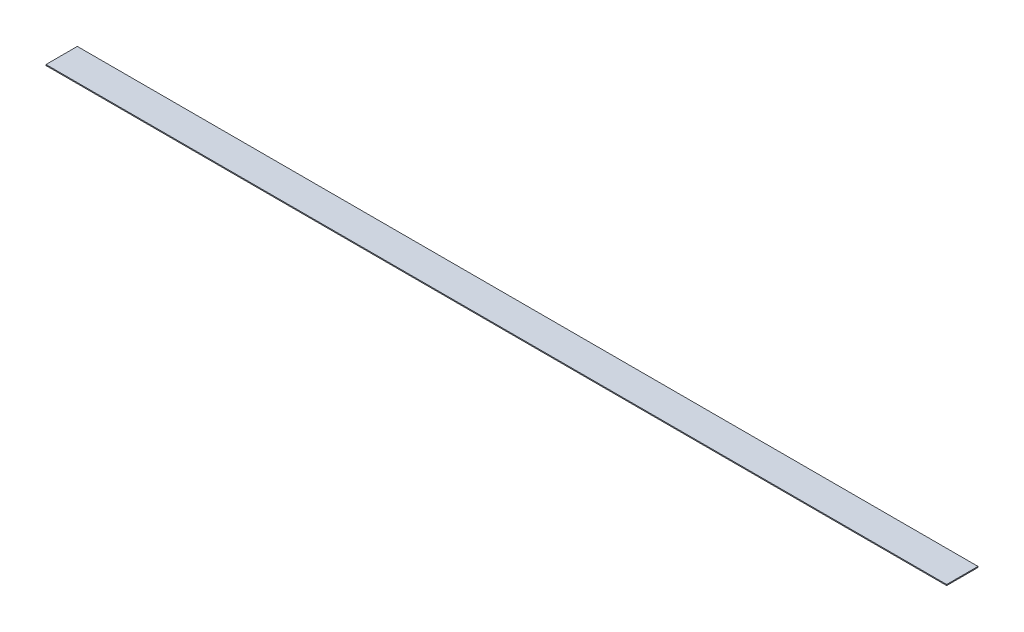
ISO-10303-21;
HEADER;
FILE_DESCRIPTION(('STEP AP214'),'2;1');
FILE_NAME('part.step','',(''),(''),'','','');
FILE_SCHEMA(('AUTOMOTIVE_DESIGN { 1 0 10303 214 1 1 1 1 }'));
ENDSEC;
DATA;
#1=APPLICATION_CONTEXT('core data for automotive mechanical design processes');
#2=APPLICATION_PROTOCOL_DEFINITION('international standard','automotive_design',2000,#1);
#3=PRODUCT_CONTEXT('',#1,'mechanical');
#4=PRODUCT('Part','Part','',(#3));
#5=PRODUCT_RELATED_PRODUCT_CATEGORY('part','',(#4));
#6=PRODUCT_DEFINITION_FORMATION('','',#4);
#7=PRODUCT_DEFINITION_CONTEXT('part definition',#1,'design');
#8=PRODUCT_DEFINITION('design','',#6,#7);
#9=PRODUCT_DEFINITION_SHAPE('','',#8);
#10=(LENGTH_UNIT() NAMED_UNIT(*) SI_UNIT(.MILLI.,.METRE.));
#11=(NAMED_UNIT(*) PLANE_ANGLE_UNIT() SI_UNIT($,.RADIAN.));
#12=(NAMED_UNIT(*) SI_UNIT($,.STERADIAN.) SOLID_ANGLE_UNIT());
#13=UNCERTAINTY_MEASURE_WITH_UNIT(LENGTH_MEASURE(1.E-05),#10,'distance_accuracy_value','');
#14=(GEOMETRIC_REPRESENTATION_CONTEXT(3) GLOBAL_UNCERTAINTY_ASSIGNED_CONTEXT((#13)) GLOBAL_UNIT_ASSIGNED_CONTEXT((#10,
#11,#12)) REPRESENTATION_CONTEXT('',''));
#15=CARTESIAN_POINT('',(0.,0.,0.));
#16=DIRECTION('',(0.,0.,1.));
#17=DIRECTION('',(1.,0.,0.));
#18=AXIS2_PLACEMENT_3D('',#15,#16,#17);
#19=CARTESIAN_POINT('',(0.,1.5875,0.));
#20=DIRECTION('',(1.,0.,0.));
#21=DIRECTION('',(0.,0.,-1.));
#22=AXIS2_PLACEMENT_3D('',#19,#20,#21);
#23=PLANE('',#22);
#24=DIRECTION('',(0.,0.,1.));
#25=VECTOR('',#24,1.);
#26=CARTESIAN_POINT('',(0.,0.,0.));
#27=LINE('',#26,#25);
#28=CARTESIAN_POINT('',(0.,0.,-50.8));
#29=VERTEX_POINT('',#28);
#30=CARTESIAN_POINT('',(0.,0.,0.));
#31=VERTEX_POINT('',#30);
#32=EDGE_CURVE('E96',#29,#31,#27,.T.);
#33=ORIENTED_EDGE('',*,*,#32,.T.);
#34=DIRECTION('',(0.,-1.,0.));
#35=VECTOR('',#34,1.);
#36=CARTESIAN_POINT('',(0.,1.5875,0.));
#37=LINE('',#36,#35);
#38=CARTESIAN_POINT('',(0.,1.5875,0.));
#39=VERTEX_POINT('',#38);
#40=EDGE_CURVE('E11',#39,#31,#37,.T.);
#41=ORIENTED_EDGE('',*,*,#40,.F.);
#42=DIRECTION('',(0.,0.,1.));
#43=VECTOR('',#42,1.);
#44=CARTESIAN_POINT('',(0.,1.5875,0.));
#45=LINE('',#44,#43);
#46=CARTESIAN_POINT('',(0.,1.5875,-50.8));
#47=VERTEX_POINT('',#46);
#48=EDGE_CURVE('E84',#47,#39,#45,.T.);
#49=ORIENTED_EDGE('',*,*,#48,.F.);
#50=DIRECTION('',(0.,-1.,0.));
#51=VECTOR('',#50,1.);
#52=CARTESIAN_POINT('',(0.,1.5875,-50.8));
#53=LINE('',#52,#51);
#54=EDGE_CURVE('E92',#47,#29,#53,.T.);
#55=ORIENTED_EDGE('',*,*,#54,.T.);
#56=EDGE_LOOP('',(#33,#41,#49,#55));
#57=FACE_BOUND('',#56,.T.);
#58=ADVANCED_FACE('F33',(#57),#23,.F.);
#59=CARTESIAN_POINT('',(0.,1.5875,0.));
#60=DIRECTION('',(0.,0.,-1.));
#61=DIRECTION('',(-1.,0.,0.));
#62=AXIS2_PLACEMENT_3D('',#59,#60,#61);
#63=PLANE('',#62);
#64=DIRECTION('',(1.,0.,0.));
#65=VECTOR('',#64,1.);
#66=CARTESIAN_POINT('',(0.,0.,0.));
#67=LINE('',#66,#65);
#68=CARTESIAN_POINT('',(1460.5,0.,0.));
#69=VERTEX_POINT('',#68);
#70=EDGE_CURVE('E88',#31,#69,#67,.T.);
#71=ORIENTED_EDGE('',*,*,#70,.T.);
#72=DIRECTION('',(0.,-1.,0.));
#73=VECTOR('',#72,1.);
#74=CARTESIAN_POINT('',(1460.5,1.5875,0.));
#75=LINE('',#74,#73);
#76=CARTESIAN_POINT('',(1460.5,1.5875,0.));
#77=VERTEX_POINT('',#76);
#78=EDGE_CURVE('E41',#77,#69,#75,.T.);
#79=ORIENTED_EDGE('',*,*,#78,.F.);
#80=DIRECTION('',(1.,0.,0.));
#81=VECTOR('',#80,1.);
#82=CARTESIAN_POINT('',(0.,1.5875,0.));
#83=LINE('',#82,#81);
#84=EDGE_CURVE('E79',#39,#77,#83,.T.);
#85=ORIENTED_EDGE('',*,*,#84,.F.);
#86=ORIENTED_EDGE('',*,*,#40,.T.);
#87=EDGE_LOOP('',(#71,#79,#85,#86));
#88=FACE_BOUND('',#87,.T.);
#89=ADVANCED_FACE('F87',(#88),#63,.F.);
#90=CARTESIAN_POINT('',(1460.5,1.5875,0.));
#91=DIRECTION('',(-1.,0.,0.));
#92=DIRECTION('',(0.,0.,1.));
#93=AXIS2_PLACEMENT_3D('',#90,#91,#92);
#94=PLANE('',#93);
#95=DIRECTION('',(0.,0.,-1.));
#96=VECTOR('',#95,1.);
#97=CARTESIAN_POINT('',(1460.5,0.,0.));
#98=LINE('',#97,#96);
#99=CARTESIAN_POINT('',(1460.5,0.,-50.8));
#100=VERTEX_POINT('',#99);
#101=EDGE_CURVE('E66',#69,#100,#98,.T.);
#102=ORIENTED_EDGE('',*,*,#101,.T.);
#103=DIRECTION('',(0.,-1.,0.));
#104=VECTOR('',#103,1.);
#105=CARTESIAN_POINT('',(1460.5,1.5875,-50.8));
#106=LINE('',#105,#104);
#107=CARTESIAN_POINT('',(1460.5,1.5875,-50.8));
#108=VERTEX_POINT('',#107);
#109=EDGE_CURVE('E89',#108,#100,#106,.T.);
#110=ORIENTED_EDGE('',*,*,#109,.F.);
#111=DIRECTION('',(0.,0.,-1.));
#112=VECTOR('',#111,1.);
#113=CARTESIAN_POINT('',(1460.5,1.5875,0.));
#114=LINE('',#113,#112);
#115=EDGE_CURVE('E82',#77,#108,#114,.T.);
#116=ORIENTED_EDGE('',*,*,#115,.F.);
#117=ORIENTED_EDGE('',*,*,#78,.T.);
#118=EDGE_LOOP('',(#102,#110,#116,#117));
#119=FACE_BOUND('',#118,.T.);
#120=ADVANCED_FACE('F90',(#119),#94,.F.);
#121=CARTESIAN_POINT('',(0.,1.5875,-50.8));
#122=DIRECTION('',(0.,0.,1.));
#123=DIRECTION('',(1.,0.,0.));
#124=AXIS2_PLACEMENT_3D('',#121,#122,#123);
#125=PLANE('',#124);
#126=DIRECTION('',(-1.,0.,0.));
#127=VECTOR('',#126,1.);
#128=CARTESIAN_POINT('',(0.,0.,-50.8));
#129=LINE('',#128,#127);
#130=EDGE_CURVE('E72',#100,#29,#129,.T.);
#131=ORIENTED_EDGE('',*,*,#130,.T.);
#132=ORIENTED_EDGE('',*,*,#54,.F.);
#133=DIRECTION('',(-1.,0.,0.));
#134=VECTOR('',#133,1.);
#135=CARTESIAN_POINT('',(0.,1.5875,-50.8));
#136=LINE('',#135,#134);
#137=EDGE_CURVE('E49',#108,#47,#136,.T.);
#138=ORIENTED_EDGE('',*,*,#137,.F.);
#139=ORIENTED_EDGE('',*,*,#109,.T.);
#140=EDGE_LOOP('',(#131,#132,#138,#139));
#141=FACE_BOUND('',#140,.T.);
#142=ADVANCED_FACE('F103',(#141),#125,.F.);
#143=CARTESIAN_POINT('',(0.,1.5875,0.));
#144=DIRECTION('',(0.,-1.,0.));
#145=DIRECTION('',(0.,0.,-1.));
#146=AXIS2_PLACEMENT_3D('',#143,#144,#145);
#147=PLANE('',#146);
#148=ORIENTED_EDGE('',*,*,#48,.T.);
#149=ORIENTED_EDGE('',*,*,#84,.T.);
#150=ORIENTED_EDGE('',*,*,#115,.T.);
#151=ORIENTED_EDGE('',*,*,#137,.T.);
#152=EDGE_LOOP('',(#148,#149,#150,#151));
#153=FACE_BOUND('',#152,.T.);
#154=ADVANCED_FACE('F80',(#153),#147,.F.);
#155=CARTESIAN_POINT('',(0.,0.,0.));
#156=DIRECTION('',(0.,-1.,0.));
#157=DIRECTION('',(0.,0.,-1.));
#158=AXIS2_PLACEMENT_3D('',#155,#156,#157);
#159=PLANE('',#158);
#160=ORIENTED_EDGE('',*,*,#32,.F.);
#161=ORIENTED_EDGE('',*,*,#130,.F.);
#162=ORIENTED_EDGE('',*,*,#101,.F.);
#163=ORIENTED_EDGE('',*,*,#70,.F.);
#164=EDGE_LOOP('',(#160,#161,#162,#163));
#165=FACE_BOUND('',#164,.T.);
#166=ADVANCED_FACE('F106',(#165),#159,.T.);
#167=CLOSED_SHELL('',(#58,#89,#120,#142,#154,#166));
#168=MANIFOLD_SOLID_BREP('B2',#167);
#169=ADVANCED_BREP_SHAPE_REPRESENTATION('',(#18,#168),#14);
#170=SHAPE_DEFINITION_REPRESENTATION(#9,#169);
ENDSEC;
END-ISO-10303-21;
